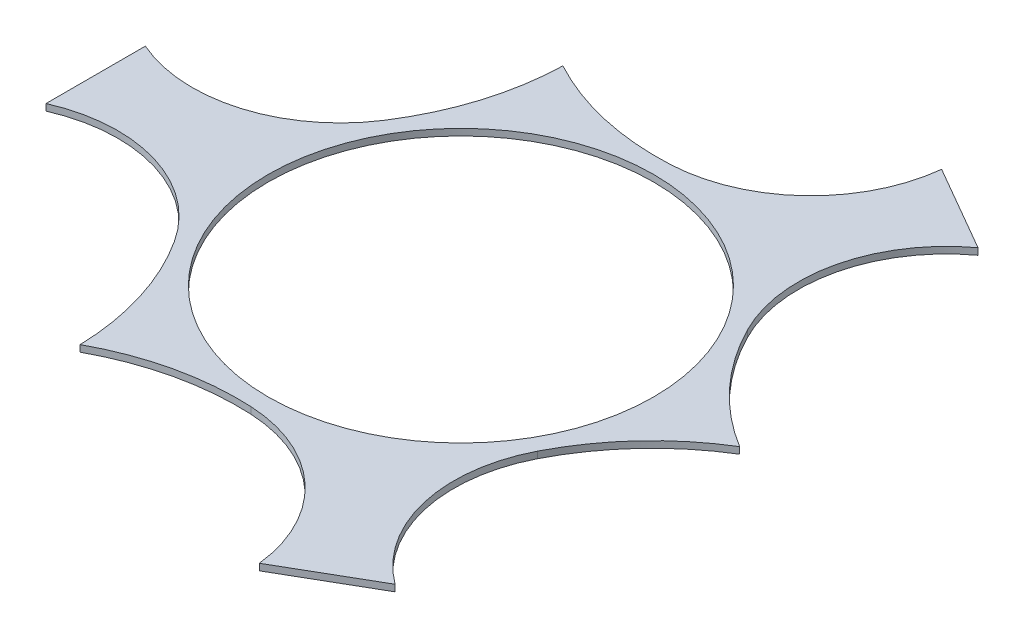
ISO-10303-21;
HEADER;
FILE_DESCRIPTION(('STEP AP214'),'2;1');
FILE_NAME('part.step','',(''),(''),'','','');
FILE_SCHEMA(('AUTOMOTIVE_DESIGN { 1 0 10303 214 1 1 1 1 }'));
ENDSEC;
DATA;
#1=APPLICATION_CONTEXT('core data for automotive mechanical design processes');
#2=APPLICATION_PROTOCOL_DEFINITION('international standard','automotive_design',2000,#1);
#3=PRODUCT_CONTEXT('',#1,'mechanical');
#4=PRODUCT('Part','Part','',(#3));
#5=PRODUCT_RELATED_PRODUCT_CATEGORY('part','',(#4));
#6=PRODUCT_DEFINITION_FORMATION('','',#4);
#7=PRODUCT_DEFINITION_CONTEXT('part definition',#1,'design');
#8=PRODUCT_DEFINITION('design','',#6,#7);
#9=PRODUCT_DEFINITION_SHAPE('','',#8);
#10=(LENGTH_UNIT() NAMED_UNIT(*) SI_UNIT(.MILLI.,.METRE.));
#11=(NAMED_UNIT(*) PLANE_ANGLE_UNIT() SI_UNIT($,.RADIAN.));
#12=(NAMED_UNIT(*) SI_UNIT($,.STERADIAN.) SOLID_ANGLE_UNIT());
#13=UNCERTAINTY_MEASURE_WITH_UNIT(LENGTH_MEASURE(1.E-05),#10,'distance_accuracy_value','');
#14=(GEOMETRIC_REPRESENTATION_CONTEXT(3) GLOBAL_UNCERTAINTY_ASSIGNED_CONTEXT((#13)) GLOBAL_UNIT_ASSIGNED_CONTEXT((#10,
#11,#12)) REPRESENTATION_CONTEXT('',''));
#15=CARTESIAN_POINT('',(0.,0.,0.));
#16=DIRECTION('',(0.,0.,1.));
#17=DIRECTION('',(1.,0.,0.));
#18=AXIS2_PLACEMENT_3D('',#15,#16,#17);
#19=CARTESIAN_POINT('',(-294.228786842325,6.35,178.189957751848));
#20=DIRECTION('',(0.,-1.,0.));
#21=DIRECTION('',(0.,0.,-1.));
#22=AXIS2_PLACEMENT_3D('',#19,#20,#21);
#23=PLANE('',#22);
#24=CARTESIAN_POINT('',(-294.228786842325,6.35,178.189957751848));
#25=DIRECTION('',(0.,-1.,0.));
#26=DIRECTION('',(0.,0.,-1.));
#27=AXIS2_PLACEMENT_3D('',#24,#25,#26);
#28=CIRCLE('',#27,142.36106232039);
#29=CARTESIAN_POINT('',(-351.324940876209,6.35,47.7802140225965));
#30=VERTEX_POINT('',#29);
#31=CARTESIAN_POINT('',(-174.699704525612,6.35,100.862921435211));
#32=VERTEX_POINT('',#31);
#33=EDGE_CURVE('E200',#30,#32,#28,.T.);
#34=ORIENTED_EDGE('',*,*,#33,.T.);
#35=CARTESIAN_POINT('',(-387.962983217068,6.35,238.829489710901));
#36=DIRECTION('',(0.,-1.,0.));
#37=DIRECTION('',(0.,0.,-1.));
#38=AXIS2_PLACEMENT_3D('',#35,#36,#37);
#39=CIRCLE('',#38,254.);
#40=CARTESIAN_POINT('',(-134.05,6.35,232.181410754608));
#41=VERTEX_POINT('',#40);
#42=EDGE_CURVE('E113',#32,#41,#39,.T.);
#43=ORIENTED_EDGE('',*,*,#42,.T.);
#44=CARTESIAN_POINT('',(-12.8509136539802,6.35,455.400544049427));
#45=DIRECTION('',(0.,-1.,0.));
#46=DIRECTION('',(0.,0.,1.));
#47=AXIS2_PLACEMENT_3D('',#44,#45,#46);
#48=CIRCLE('',#47,254.);
#49=CARTESIAN_POINT('',(2.47198095326695E-13,6.35,201.725842870421));
#50=VERTEX_POINT('',#49);
#51=EDGE_CURVE('E236',#41,#50,#48,.T.);
#52=ORIENTED_EDGE('',*,*,#51,.T.);
#53=CARTESIAN_POINT('',(-7.20263669121243,6.35,343.904582806054));
#54=DIRECTION('',(0.,-1.,0.));
#55=DIRECTION('',(0.,0.,1.));
#56=AXIS2_PLACEMENT_3D('',#53,#54,#55);
#57=CIRCLE('',#56,142.36106232039);
#58=CARTESIAN_POINT('',(134.28359129628,6.35,328.146430793161));
#59=VERTEX_POINT('',#58);
#60=EDGE_CURVE('E255',#50,#59,#57,.T.);
#61=ORIENTED_EDGE('',*,*,#60,.T.);
#62=DIRECTION('',(0.866025403784438,0.,-0.500000000000001));
#63=VECTOR('',#62,1.);
#64=CARTESIAN_POINT('',(217.041349579932,6.35,280.366216770564));
#65=LINE('',#64,#63);
#66=CARTESIAN_POINT('',(217.041349579931,6.35,280.366216770565));
#67=VERTEX_POINT('',#66);
#68=EDGE_CURVE('E252',#59,#67,#65,.T.);
#69=ORIENTED_EDGE('',*,*,#68,.T.);
#70=CARTESIAN_POINT('',(301.43142353354,6.35,165.714625054206));
#71=DIRECTION('',(0.,-1.,0.));
#72=DIRECTION('',(0.,0.,-1.));
#73=AXIS2_PLACEMENT_3D('',#70,#71,#72);
#74=CIRCLE('',#73,142.361062320391);
#75=CARTESIAN_POINT('',(174.699704525613,6.35,100.86292143521));
#76=VERTEX_POINT('',#75);
#77=EDGE_CURVE('E254',#67,#76,#74,.T.);
#78=ORIENTED_EDGE('',*,*,#77,.T.);
#79=CARTESIAN_POINT('',(400.813896871049,6.35,216.571054338526));
#80=DIRECTION('',(0.,-1.,0.));
#81=DIRECTION('',(0.,0.,-1.));
#82=AXIS2_PLACEMENT_3D('',#79,#80,#81);
#83=CIRCLE('',#82,254.);
#84=CARTESIAN_POINT('',(268.1,6.35,0.));
#85=VERTEX_POINT('',#84);
#86=EDGE_CURVE('E257',#76,#85,#83,.T.);
#87=ORIENTED_EDGE('',*,*,#86,.T.);
#88=CARTESIAN_POINT('',(400.813896871048,6.35,-216.571054338526));
#89=DIRECTION('',(0.,-1.,0.));
#90=DIRECTION('',(0.,0.,1.));
#91=AXIS2_PLACEMENT_3D('',#88,#89,#90);
#92=CIRCLE('',#91,254.);
#93=CARTESIAN_POINT('',(174.699704525613,6.35,-100.862921435211));
#94=VERTEX_POINT('',#93);
#95=EDGE_CURVE('E263',#85,#94,#92,.T.);
#96=ORIENTED_EDGE('',*,*,#95,.T.);
#97=CARTESIAN_POINT('',(301.431423533539,6.35,-165.714625054207));
#98=DIRECTION('',(0.,-1.,0.));
#99=DIRECTION('',(0.,0.,1.));
#100=AXIS2_PLACEMENT_3D('',#97,#98,#99);
#101=CIRCLE('',#100,142.361062320391);
#102=CARTESIAN_POINT('',(217.041349579931,6.35,-280.366216770566));
#103=VERTEX_POINT('',#102);
#104=EDGE_CURVE('E265',#94,#103,#101,.T.);
#105=ORIENTED_EDGE('',*,*,#104,.T.);
#106=DIRECTION('',(-0.866025403784439,0.,-0.5));
#107=VECTOR('',#106,1.);
#108=CARTESIAN_POINT('',(134.283591296279,6.35,-328.146430793162));
#109=LINE('',#108,#107);
#110=CARTESIAN_POINT('',(134.283591296279,6.35,-328.146430793162));
#111=VERTEX_POINT('',#110);
#112=EDGE_CURVE('E267',#103,#111,#109,.T.);
#113=ORIENTED_EDGE('',*,*,#112,.T.);
#114=CARTESIAN_POINT('',(-7.20263669121332,6.35,-343.904582806055));
#115=DIRECTION('',(0.,-1.,0.));
#116=DIRECTION('',(0.,0.,-1.));
#117=AXIS2_PLACEMENT_3D('',#114,#115,#116);
#118=CIRCLE('',#117,142.361062320391);
#119=CARTESIAN_POINT('',(0.,6.35,-201.725842870421));
#120=VERTEX_POINT('',#119);
#121=EDGE_CURVE('E269',#111,#120,#118,.T.);
#122=ORIENTED_EDGE('',*,*,#121,.T.);
#123=CARTESIAN_POINT('',(-12.8509136539806,6.35,-455.400544049427));
#124=DIRECTION('',(0.,-1.,0.));
#125=DIRECTION('',(0.,0.,-1.));
#126=AXIS2_PLACEMENT_3D('',#123,#124,#125);
#127=CIRCLE('',#126,254.);
#128=CARTESIAN_POINT('',(-134.05,6.35,-232.181410754608));
#129=VERTEX_POINT('',#128);
#130=EDGE_CURVE('E153',#120,#129,#127,.T.);
#131=ORIENTED_EDGE('',*,*,#130,.T.);
#132=CARTESIAN_POINT('',(-387.962983217068,6.35,-238.829489710901));
#133=DIRECTION('',(0.,-1.,0.));
#134=DIRECTION('',(0.,0.,1.));
#135=AXIS2_PLACEMENT_3D('',#132,#133,#134);
#136=CIRCLE('',#135,254.);
#137=CARTESIAN_POINT('',(-174.699704525612,6.35,-100.862921435211));
#138=VERTEX_POINT('',#137);
#139=EDGE_CURVE('E147',#129,#138,#136,.T.);
#140=ORIENTED_EDGE('',*,*,#139,.T.);
#141=CARTESIAN_POINT('',(-294.228786842325,6.35,-178.189957751848));
#142=DIRECTION('',(0.,-1.,0.));
#143=DIRECTION('',(0.,0.,1.));
#144=AXIS2_PLACEMENT_3D('',#141,#142,#143);
#145=CIRCLE('',#144,142.36106232039);
#146=CARTESIAN_POINT('',(-351.324940876209,6.35,-47.7802140225964));
#147=VERTEX_POINT('',#146);
#148=EDGE_CURVE('E151',#138,#147,#145,.T.);
#149=ORIENTED_EDGE('',*,*,#148,.T.);
#150=DIRECTION('',(0.,0.,1.));
#151=VECTOR('',#150,1.);
#152=CARTESIAN_POINT('',(-351.324940876209,6.35,47.7802140225965));
#153=LINE('',#152,#151);
#154=EDGE_CURVE('E49',#147,#30,#153,.T.);
#155=ORIENTED_EDGE('',*,*,#154,.T.);
#156=EDGE_LOOP('',(#34,#43,#52,#61,#69,#78,#87,#96,#105,#113,#122,#131,#140,#149,#155));
#157=FACE_BOUND('',#156,.T.);
#158=CARTESIAN_POINT('',(0.,6.35,0.));
#159=DIRECTION('',(0.,1.,0.));
#160=DIRECTION('',(0.,0.,1.));
#161=AXIS2_PLACEMENT_3D('',#158,#159,#160);
#162=CIRCLE('',#161,185.399607795928);
#163=CARTESIAN_POINT('',(0.,6.35,185.399607795928));
#164=VERTEX_POINT('',#163);
#165=EDGE_CURVE('E175',#164,#164,#162,.T.);
#166=ORIENTED_EDGE('',*,*,#165,.F.);
#167=EDGE_LOOP('',(#166));
#168=FACE_BOUND('',#167,.T.);
#169=ADVANCED_FACE('F32',(#157,#168),#23,.F.);
#170=CARTESIAN_POINT('',(-294.228786842325,0.,178.189957751848));
#171=DIRECTION('',(0.,-1.,0.));
#172=DIRECTION('',(0.,0.,-1.));
#173=AXIS2_PLACEMENT_3D('',#170,#171,#172);
#174=PLANE('',#173);
#175=CARTESIAN_POINT('',(-294.228786842325,0.,178.189957751848));
#176=DIRECTION('',(0.,-1.,0.));
#177=DIRECTION('',(0.,0.,-1.));
#178=AXIS2_PLACEMENT_3D('',#175,#176,#177);
#179=CIRCLE('',#178,142.36106232039);
#180=CARTESIAN_POINT('',(-351.324940876209,0.,47.7802140225965));
#181=VERTEX_POINT('',#180);
#182=CARTESIAN_POINT('',(-174.699704525612,0.,100.862921435211));
#183=VERTEX_POINT('',#182);
#184=EDGE_CURVE('E171',#181,#183,#179,.T.);
#185=ORIENTED_EDGE('',*,*,#184,.F.);
#186=DIRECTION('',(0.,0.,1.));
#187=VECTOR('',#186,1.);
#188=CARTESIAN_POINT('',(-351.324940876209,0.,47.7802140225965));
#189=LINE('',#188,#187);
#190=CARTESIAN_POINT('',(-351.324940876209,0.,-47.7802140225964));
#191=VERTEX_POINT('',#190);
#192=EDGE_CURVE('E105',#191,#181,#189,.T.);
#193=ORIENTED_EDGE('',*,*,#192,.F.);
#194=CARTESIAN_POINT('',(-294.228786842325,0.,-178.189957751848));
#195=DIRECTION('',(0.,-1.,0.));
#196=DIRECTION('',(0.,0.,1.));
#197=AXIS2_PLACEMENT_3D('',#194,#195,#196);
#198=CIRCLE('',#197,142.36106232039);
#199=CARTESIAN_POINT('',(-174.699704525612,0.,-100.862921435211));
#200=VERTEX_POINT('',#199);
#201=EDGE_CURVE('E99',#200,#191,#198,.T.);
#202=ORIENTED_EDGE('',*,*,#201,.F.);
#203=CARTESIAN_POINT('',(-387.962983217068,0.,-238.829489710901));
#204=DIRECTION('',(0.,-1.,0.));
#205=DIRECTION('',(0.,0.,1.));
#206=AXIS2_PLACEMENT_3D('',#203,#204,#205);
#207=CIRCLE('',#206,254.);
#208=CARTESIAN_POINT('',(-134.05,0.,-232.181410754608));
#209=VERTEX_POINT('',#208);
#210=EDGE_CURVE('E161',#209,#200,#207,.T.);
#211=ORIENTED_EDGE('',*,*,#210,.F.);
#212=CARTESIAN_POINT('',(-12.8509136539806,0.,-455.400544049427));
#213=DIRECTION('',(0.,-1.,0.));
#214=DIRECTION('',(0.,0.,-1.));
#215=AXIS2_PLACEMENT_3D('',#212,#213,#214);
#216=CIRCLE('',#215,254.);
#217=CARTESIAN_POINT('',(0.,0.,-201.725842870421));
#218=VERTEX_POINT('',#217);
#219=EDGE_CURVE('E195',#218,#209,#216,.T.);
#220=ORIENTED_EDGE('',*,*,#219,.F.);
#221=CARTESIAN_POINT('',(-7.20263669121332,0.,-343.904582806055));
#222=DIRECTION('',(0.,-1.,0.));
#223=DIRECTION('',(0.,0.,-1.));
#224=AXIS2_PLACEMENT_3D('',#221,#222,#223);
#225=CIRCLE('',#224,142.361062320391);
#226=CARTESIAN_POINT('',(134.283591296279,0.,-328.146430793162));
#227=VERTEX_POINT('',#226);
#228=EDGE_CURVE('E193',#227,#218,#225,.T.);
#229=ORIENTED_EDGE('',*,*,#228,.F.);
#230=DIRECTION('',(-0.866025403784439,0.,-0.5));
#231=VECTOR('',#230,1.);
#232=CARTESIAN_POINT('',(134.283591296279,0.,-328.146430793162));
#233=LINE('',#232,#231);
#234=CARTESIAN_POINT('',(217.041349579931,0.,-280.366216770566));
#235=VERTEX_POINT('',#234);
#236=EDGE_CURVE('E191',#235,#227,#233,.T.);
#237=ORIENTED_EDGE('',*,*,#236,.F.);
#238=CARTESIAN_POINT('',(301.431423533539,0.,-165.714625054207));
#239=DIRECTION('',(0.,-1.,0.));
#240=DIRECTION('',(0.,0.,1.));
#241=AXIS2_PLACEMENT_3D('',#238,#239,#240);
#242=CIRCLE('',#241,142.361062320391);
#243=CARTESIAN_POINT('',(174.699704525613,0.,-100.862921435211));
#244=VERTEX_POINT('',#243);
#245=EDGE_CURVE('E189',#244,#235,#242,.T.);
#246=ORIENTED_EDGE('',*,*,#245,.F.);
#247=CARTESIAN_POINT('',(400.813896871048,0.,-216.571054338526));
#248=DIRECTION('',(0.,-1.,0.));
#249=DIRECTION('',(0.,0.,1.));
#250=AXIS2_PLACEMENT_3D('',#247,#248,#249);
#251=CIRCLE('',#250,254.);
#252=CARTESIAN_POINT('',(268.1,0.,0.));
#253=VERTEX_POINT('',#252);
#254=EDGE_CURVE('E187',#253,#244,#251,.T.);
#255=ORIENTED_EDGE('',*,*,#254,.F.);
#256=CARTESIAN_POINT('',(400.813896871049,0.,216.571054338526));
#257=DIRECTION('',(0.,-1.,0.));
#258=DIRECTION('',(0.,0.,-1.));
#259=AXIS2_PLACEMENT_3D('',#256,#257,#258);
#260=CIRCLE('',#259,254.);
#261=CARTESIAN_POINT('',(174.699704525613,0.,100.86292143521));
#262=VERTEX_POINT('',#261);
#263=EDGE_CURVE('E185',#262,#253,#260,.T.);
#264=ORIENTED_EDGE('',*,*,#263,.F.);
#265=CARTESIAN_POINT('',(301.43142353354,0.,165.714625054206));
#266=DIRECTION('',(0.,-1.,0.));
#267=DIRECTION('',(0.,0.,-1.));
#268=AXIS2_PLACEMENT_3D('',#265,#266,#267);
#269=CIRCLE('',#268,142.361062320391);
#270=CARTESIAN_POINT('',(217.041349579931,0.,280.366216770565));
#271=VERTEX_POINT('',#270);
#272=EDGE_CURVE('E183',#271,#262,#269,.T.);
#273=ORIENTED_EDGE('',*,*,#272,.F.);
#274=DIRECTION('',(0.866025403784438,0.,-0.500000000000001));
#275=VECTOR('',#274,1.);
#276=CARTESIAN_POINT('',(217.041349579932,0.,280.366216770564));
#277=LINE('',#276,#275);
#278=CARTESIAN_POINT('',(134.28359129628,0.,328.146430793161));
#279=VERTEX_POINT('',#278);
#280=EDGE_CURVE('E181',#279,#271,#277,.T.);
#281=ORIENTED_EDGE('',*,*,#280,.F.);
#282=CARTESIAN_POINT('',(-7.20263669121243,0.,343.904582806054));
#283=DIRECTION('',(0.,-1.,0.));
#284=DIRECTION('',(0.,0.,1.));
#285=AXIS2_PLACEMENT_3D('',#282,#283,#284);
#286=CIRCLE('',#285,142.36106232039);
#287=CARTESIAN_POINT('',(2.47198095326695E-13,0.,201.725842870421));
#288=VERTEX_POINT('',#287);
#289=EDGE_CURVE('E179',#288,#279,#286,.T.);
#290=ORIENTED_EDGE('',*,*,#289,.F.);
#291=CARTESIAN_POINT('',(-12.8509136539802,0.,455.400544049427));
#292=DIRECTION('',(0.,-1.,0.));
#293=DIRECTION('',(0.,0.,1.));
#294=AXIS2_PLACEMENT_3D('',#291,#292,#293);
#295=CIRCLE('',#294,254.);
#296=CARTESIAN_POINT('',(-134.05,0.,232.181410754608));
#297=VERTEX_POINT('',#296);
#298=EDGE_CURVE('E177',#297,#288,#295,.T.);
#299=ORIENTED_EDGE('',*,*,#298,.F.);
#300=CARTESIAN_POINT('',(-387.962983217068,0.,238.829489710901));
#301=DIRECTION('',(0.,-1.,0.));
#302=DIRECTION('',(0.,0.,-1.));
#303=AXIS2_PLACEMENT_3D('',#300,#301,#302);
#304=CIRCLE('',#303,254.);
#305=EDGE_CURVE('E174',#183,#297,#304,.T.);
#306=ORIENTED_EDGE('',*,*,#305,.F.);
#307=EDGE_LOOP('',(#185,#193,#202,#211,#220,#229,#237,#246,#255,#264,#273,#281,#290,#299,#306));
#308=FACE_BOUND('',#307,.T.);
#309=CARTESIAN_POINT('',(0.,0.,0.));
#310=DIRECTION('',(0.,1.,0.));
#311=DIRECTION('',(0.,0.,1.));
#312=AXIS2_PLACEMENT_3D('',#309,#310,#311);
#313=CIRCLE('',#312,185.399607795928);
#314=CARTESIAN_POINT('',(0.,0.,185.399607795928));
#315=VERTEX_POINT('',#314);
#316=EDGE_CURVE('E455',#315,#315,#313,.T.);
#317=ORIENTED_EDGE('',*,*,#316,.T.);
#318=EDGE_LOOP('',(#317));
#319=FACE_BOUND('',#318,.T.);
#320=ADVANCED_FACE('F240',(#308,#319),#174,.T.);
#321=CARTESIAN_POINT('',(-294.228786842325,6.35,178.189957751848));
#322=DIRECTION('',(0.,-1.,0.));
#323=DIRECTION('',(0.,0.,-1.));
#324=AXIS2_PLACEMENT_3D('',#321,#322,#323);
#325=CYLINDRICAL_SURFACE('',#324,142.36106232039);
#326=ORIENTED_EDGE('',*,*,#184,.T.);
#327=DIRECTION('',(0.,-1.,0.));
#328=VECTOR('',#327,1.);
#329=CARTESIAN_POINT('',(-174.699704525612,6.35,100.862921435211));
#330=LINE('',#329,#328);
#331=EDGE_CURVE('E11',#32,#183,#330,.T.);
#332=ORIENTED_EDGE('',*,*,#331,.F.);
#333=ORIENTED_EDGE('',*,*,#33,.F.);
#334=DIRECTION('',(0.,-1.,0.));
#335=VECTOR('',#334,1.);
#336=CARTESIAN_POINT('',(-351.324940876209,6.35,47.7802140225965));
#337=LINE('',#336,#335);
#338=EDGE_CURVE('E167',#30,#181,#337,.T.);
#339=ORIENTED_EDGE('',*,*,#338,.T.);
#340=EDGE_LOOP('',(#326,#332,#333,#339));
#341=FACE_BOUND('',#340,.T.);
#342=ADVANCED_FACE('F34',(#341),#325,.F.);
#343=CARTESIAN_POINT('',(-387.962983217068,6.35,238.829489710901));
#344=DIRECTION('',(0.,-1.,0.));
#345=DIRECTION('',(0.,0.,-1.));
#346=AXIS2_PLACEMENT_3D('',#343,#344,#345);
#347=CYLINDRICAL_SURFACE('',#346,254.);
#348=ORIENTED_EDGE('',*,*,#305,.T.);
#349=DIRECTION('',(0.,-1.,0.));
#350=VECTOR('',#349,1.);
#351=CARTESIAN_POINT('',(-134.05,6.35,232.181410754608));
#352=LINE('',#351,#350);
#353=EDGE_CURVE('E41',#41,#297,#352,.T.);
#354=ORIENTED_EDGE('',*,*,#353,.F.);
#355=ORIENTED_EDGE('',*,*,#42,.F.);
#356=ORIENTED_EDGE('',*,*,#331,.T.);
#357=EDGE_LOOP('',(#348,#354,#355,#356));
#358=FACE_BOUND('',#357,.T.);
#359=ADVANCED_FACE('F303',(#358),#347,.F.);
#360=CARTESIAN_POINT('',(-12.8509136539802,6.35,455.400544049427));
#361=DIRECTION('',(0.,-1.,0.));
#362=DIRECTION('',(0.,0.,-1.));
#363=AXIS2_PLACEMENT_3D('',#360,#361,#362);
#364=CYLINDRICAL_SURFACE('',#363,254.);
#365=ORIENTED_EDGE('',*,*,#298,.T.);
#366=DIRECTION('',(0.,-1.,0.));
#367=VECTOR('',#366,1.);
#368=CARTESIAN_POINT('',(2.47198095326695E-13,6.35,201.725842870421));
#369=LINE('',#368,#367);
#370=EDGE_CURVE('E228',#50,#288,#369,.T.);
#371=ORIENTED_EDGE('',*,*,#370,.F.);
#372=ORIENTED_EDGE('',*,*,#51,.F.);
#373=ORIENTED_EDGE('',*,*,#353,.T.);
#374=EDGE_LOOP('',(#365,#371,#372,#373));
#375=FACE_BOUND('',#374,.T.);
#376=ADVANCED_FACE('F234',(#375),#364,.F.);
#377=CARTESIAN_POINT('',(-7.20263669121243,6.35,343.904582806054));
#378=DIRECTION('',(0.,-1.,0.));
#379=DIRECTION('',(0.,0.,-1.));
#380=AXIS2_PLACEMENT_3D('',#377,#378,#379);
#381=CYLINDRICAL_SURFACE('',#380,142.36106232039);
#382=ORIENTED_EDGE('',*,*,#289,.T.);
#383=DIRECTION('',(0.,-1.,0.));
#384=VECTOR('',#383,1.);
#385=CARTESIAN_POINT('',(134.28359129628,6.35,328.146430793161));
#386=LINE('',#385,#384);
#387=EDGE_CURVE('E225',#59,#279,#386,.T.);
#388=ORIENTED_EDGE('',*,*,#387,.F.);
#389=ORIENTED_EDGE('',*,*,#60,.F.);
#390=ORIENTED_EDGE('',*,*,#370,.T.);
#391=EDGE_LOOP('',(#382,#388,#389,#390));
#392=FACE_BOUND('',#391,.T.);
#393=ADVANCED_FACE('F246',(#392),#381,.F.);
#394=CARTESIAN_POINT('',(217.041349579932,6.35,280.366216770564));
#395=DIRECTION('',(-0.500000000000001,0.,-0.866025403784438));
#396=DIRECTION('',(-0.866025403784438,0.,0.500000000000001));
#397=AXIS2_PLACEMENT_3D('',#394,#395,#396);
#398=PLANE('',#397);
#399=ORIENTED_EDGE('',*,*,#280,.T.);
#400=DIRECTION('',(0.,-1.,0.));
#401=VECTOR('',#400,1.);
#402=CARTESIAN_POINT('',(217.041349579931,6.35,280.366216770565));
#403=LINE('',#402,#401);
#404=EDGE_CURVE('E222',#67,#271,#403,.T.);
#405=ORIENTED_EDGE('',*,*,#404,.F.);
#406=ORIENTED_EDGE('',*,*,#68,.F.);
#407=ORIENTED_EDGE('',*,*,#387,.T.);
#408=EDGE_LOOP('',(#399,#405,#406,#407));
#409=FACE_BOUND('',#408,.T.);
#410=ADVANCED_FACE('F250',(#409),#398,.F.);
#411=CARTESIAN_POINT('',(301.43142353354,6.35,165.714625054206));
#412=DIRECTION('',(0.,-1.,0.));
#413=DIRECTION('',(0.,0.,-1.));
#414=AXIS2_PLACEMENT_3D('',#411,#412,#413);
#415=CYLINDRICAL_SURFACE('',#414,142.361062320391);
#416=ORIENTED_EDGE('',*,*,#272,.T.);
#417=DIRECTION('',(0.,-1.,0.));
#418=VECTOR('',#417,1.);
#419=CARTESIAN_POINT('',(174.699704525613,6.35,100.86292143521));
#420=LINE('',#419,#418);
#421=EDGE_CURVE('E219',#76,#262,#420,.T.);
#422=ORIENTED_EDGE('',*,*,#421,.F.);
#423=ORIENTED_EDGE('',*,*,#77,.F.);
#424=ORIENTED_EDGE('',*,*,#404,.T.);
#425=EDGE_LOOP('',(#416,#422,#423,#424));
#426=FACE_BOUND('',#425,.T.);
#427=ADVANCED_FACE('F316',(#426),#415,.F.);
#428=CARTESIAN_POINT('',(400.813896871049,6.35,216.571054338526));
#429=DIRECTION('',(0.,-1.,0.));
#430=DIRECTION('',(0.,0.,-1.));
#431=AXIS2_PLACEMENT_3D('',#428,#429,#430);
#432=CYLINDRICAL_SURFACE('',#431,254.);
#433=ORIENTED_EDGE('',*,*,#263,.T.);
#434=DIRECTION('',(0.,-1.,0.));
#435=VECTOR('',#434,1.);
#436=CARTESIAN_POINT('',(268.1,6.35,0.));
#437=LINE('',#436,#435);
#438=EDGE_CURVE('E216',#85,#253,#437,.T.);
#439=ORIENTED_EDGE('',*,*,#438,.F.);
#440=ORIENTED_EDGE('',*,*,#86,.F.);
#441=ORIENTED_EDGE('',*,*,#421,.T.);
#442=EDGE_LOOP('',(#433,#439,#440,#441));
#443=FACE_BOUND('',#442,.T.);
#444=ADVANCED_FACE('F319',(#443),#432,.F.);
#445=CARTESIAN_POINT('',(400.813896871048,6.35,-216.571054338526));
#446=DIRECTION('',(0.,-1.,0.));
#447=DIRECTION('',(0.,0.,-1.));
#448=AXIS2_PLACEMENT_3D('',#445,#446,#447);
#449=CYLINDRICAL_SURFACE('',#448,254.);
#450=ORIENTED_EDGE('',*,*,#254,.T.);
#451=DIRECTION('',(0.,-1.,0.));
#452=VECTOR('',#451,1.);
#453=CARTESIAN_POINT('',(174.699704525613,6.35,-100.862921435211));
#454=LINE('',#453,#452);
#455=EDGE_CURVE('E213',#94,#244,#454,.T.);
#456=ORIENTED_EDGE('',*,*,#455,.F.);
#457=ORIENTED_EDGE('',*,*,#95,.F.);
#458=ORIENTED_EDGE('',*,*,#438,.T.);
#459=EDGE_LOOP('',(#450,#456,#457,#458));
#460=FACE_BOUND('',#459,.T.);
#461=ADVANCED_FACE('F323',(#460),#449,.F.);
#462=CARTESIAN_POINT('',(301.431423533539,6.35,-165.714625054207));
#463=DIRECTION('',(0.,-1.,0.));
#464=DIRECTION('',(0.,0.,-1.));
#465=AXIS2_PLACEMENT_3D('',#462,#463,#464);
#466=CYLINDRICAL_SURFACE('',#465,142.361062320391);
#467=ORIENTED_EDGE('',*,*,#245,.T.);
#468=DIRECTION('',(0.,-1.,0.));
#469=VECTOR('',#468,1.);
#470=CARTESIAN_POINT('',(217.041349579931,6.35,-280.366216770566));
#471=LINE('',#470,#469);
#472=EDGE_CURVE('E210',#103,#235,#471,.T.);
#473=ORIENTED_EDGE('',*,*,#472,.F.);
#474=ORIENTED_EDGE('',*,*,#104,.F.);
#475=ORIENTED_EDGE('',*,*,#455,.T.);
#476=EDGE_LOOP('',(#467,#473,#474,#475));
#477=FACE_BOUND('',#476,.T.);
#478=ADVANCED_FACE('F327',(#477),#466,.F.);
#479=CARTESIAN_POINT('',(134.283591296279,6.35,-328.146430793162));
#480=DIRECTION('',(-0.5,0.,0.866025403784439));
#481=DIRECTION('',(0.866025403784439,0.,0.5));
#482=AXIS2_PLACEMENT_3D('',#479,#480,#481);
#483=PLANE('',#482);
#484=ORIENTED_EDGE('',*,*,#236,.T.);
#485=DIRECTION('',(0.,-1.,0.));
#486=VECTOR('',#485,1.);
#487=CARTESIAN_POINT('',(134.283591296279,6.35,-328.146430793162));
#488=LINE('',#487,#486);
#489=EDGE_CURVE('E207',#111,#227,#488,.T.);
#490=ORIENTED_EDGE('',*,*,#489,.F.);
#491=ORIENTED_EDGE('',*,*,#112,.F.);
#492=ORIENTED_EDGE('',*,*,#472,.T.);
#493=EDGE_LOOP('',(#484,#490,#491,#492));
#494=FACE_BOUND('',#493,.T.);
#495=ADVANCED_FACE('F331',(#494),#483,.F.);
#496=CARTESIAN_POINT('',(-7.20263669121332,6.35,-343.904582806055));
#497=DIRECTION('',(0.,-1.,0.));
#498=DIRECTION('',(0.,0.,-1.));
#499=AXIS2_PLACEMENT_3D('',#496,#497,#498);
#500=CYLINDRICAL_SURFACE('',#499,142.361062320391);
#501=ORIENTED_EDGE('',*,*,#228,.T.);
#502=DIRECTION('',(0.,-1.,0.));
#503=VECTOR('',#502,1.);
#504=CARTESIAN_POINT('',(0.,6.35,-201.725842870421));
#505=LINE('',#504,#503);
#506=EDGE_CURVE('E204',#120,#218,#505,.T.);
#507=ORIENTED_EDGE('',*,*,#506,.F.);
#508=ORIENTED_EDGE('',*,*,#121,.F.);
#509=ORIENTED_EDGE('',*,*,#489,.T.);
#510=EDGE_LOOP('',(#501,#507,#508,#509));
#511=FACE_BOUND('',#510,.T.);
#512=ADVANCED_FACE('F275',(#511),#500,.F.);
#513=CARTESIAN_POINT('',(-12.8509136539806,6.35,-455.400544049427));
#514=DIRECTION('',(0.,-1.,0.));
#515=DIRECTION('',(0.,0.,-1.));
#516=AXIS2_PLACEMENT_3D('',#513,#514,#515);
#517=CYLINDRICAL_SURFACE('',#516,254.);
#518=ORIENTED_EDGE('',*,*,#219,.T.);
#519=DIRECTION('',(0.,-1.,0.));
#520=VECTOR('',#519,1.);
#521=CARTESIAN_POINT('',(-134.05,6.35,-232.181410754608));
#522=LINE('',#521,#520);
#523=EDGE_CURVE('E162',#129,#209,#522,.T.);
#524=ORIENTED_EDGE('',*,*,#523,.F.);
#525=ORIENTED_EDGE('',*,*,#130,.F.);
#526=ORIENTED_EDGE('',*,*,#506,.T.);
#527=EDGE_LOOP('',(#518,#524,#525,#526));
#528=FACE_BOUND('',#527,.T.);
#529=ADVANCED_FACE('F279',(#528),#517,.F.);
#530=CARTESIAN_POINT('',(-387.962983217068,6.35,-238.829489710901));
#531=DIRECTION('',(0.,-1.,0.));
#532=DIRECTION('',(0.,0.,-1.));
#533=AXIS2_PLACEMENT_3D('',#530,#531,#532);
#534=CYLINDRICAL_SURFACE('',#533,254.);
#535=ORIENTED_EDGE('',*,*,#210,.T.);
#536=DIRECTION('',(0.,-1.,0.));
#537=VECTOR('',#536,1.);
#538=CARTESIAN_POINT('',(-174.699704525612,6.35,-100.862921435211));
#539=LINE('',#538,#537);
#540=EDGE_CURVE('E158',#138,#200,#539,.T.);
#541=ORIENTED_EDGE('',*,*,#540,.F.);
#542=ORIENTED_EDGE('',*,*,#139,.F.);
#543=ORIENTED_EDGE('',*,*,#523,.T.);
#544=EDGE_LOOP('',(#535,#541,#542,#543));
#545=FACE_BOUND('',#544,.T.);
#546=ADVANCED_FACE('F159',(#545),#534,.F.);
#547=CARTESIAN_POINT('',(-294.228786842325,6.35,-178.189957751848));
#548=DIRECTION('',(0.,-1.,0.));
#549=DIRECTION('',(0.,0.,-1.));
#550=AXIS2_PLACEMENT_3D('',#547,#548,#549);
#551=CYLINDRICAL_SURFACE('',#550,142.36106232039);
#552=ORIENTED_EDGE('',*,*,#201,.T.);
#553=DIRECTION('',(0.,-1.,0.));
#554=VECTOR('',#553,1.);
#555=CARTESIAN_POINT('',(-351.324940876209,6.35,-47.7802140225964));
#556=LINE('',#555,#554);
#557=EDGE_CURVE('E163',#147,#191,#556,.T.);
#558=ORIENTED_EDGE('',*,*,#557,.F.);
#559=ORIENTED_EDGE('',*,*,#148,.F.);
#560=ORIENTED_EDGE('',*,*,#540,.T.);
#561=EDGE_LOOP('',(#552,#558,#559,#560));
#562=FACE_BOUND('',#561,.T.);
#563=ADVANCED_FACE('F165',(#562),#551,.F.);
#564=CARTESIAN_POINT('',(-351.324940876209,6.35,47.7802140225965));
#565=DIRECTION('',(1.,0.,0.));
#566=DIRECTION('',(0.,0.,-1.));
#567=AXIS2_PLACEMENT_3D('',#564,#565,#566);
#568=PLANE('',#567);
#569=ORIENTED_EDGE('',*,*,#192,.T.);
#570=ORIENTED_EDGE('',*,*,#338,.F.);
#571=ORIENTED_EDGE('',*,*,#154,.F.);
#572=ORIENTED_EDGE('',*,*,#557,.T.);
#573=EDGE_LOOP('',(#569,#570,#571,#572));
#574=FACE_BOUND('',#573,.T.);
#575=ADVANCED_FACE('F283',(#574),#568,.F.);
#576=CARTESIAN_POINT('',(0.,6.35,0.));
#577=DIRECTION('',(0.,-1.,0.));
#578=DIRECTION('',(0.,0.,-1.));
#579=AXIS2_PLACEMENT_3D('',#576,#577,#578);
#580=CYLINDRICAL_SURFACE('',#579,185.399607795928);
#581=ORIENTED_EDGE('',*,*,#165,.T.);
#582=EDGE_LOOP('',(#581));
#583=FACE_BOUND('',#582,.T.);
#584=ORIENTED_EDGE('',*,*,#316,.F.);
#585=EDGE_LOOP('',(#584));
#586=FACE_BOUND('',#585,.T.);
#587=ADVANCED_FACE('F285',(#583,#586),#580,.F.);
#588=CLOSED_SHELL('',(#169,#320,#342,#359,#376,#393,#410,#427,#444,#461,#478,#495,#512,#529,
#546,#563,#575,#587));
#589=MANIFOLD_SOLID_BREP('B2',#588);
#590=ADVANCED_BREP_SHAPE_REPRESENTATION('',(#18,#589),#14);
#591=SHAPE_DEFINITION_REPRESENTATION(#9,#590);
ENDSEC;
END-ISO-10303-21;
